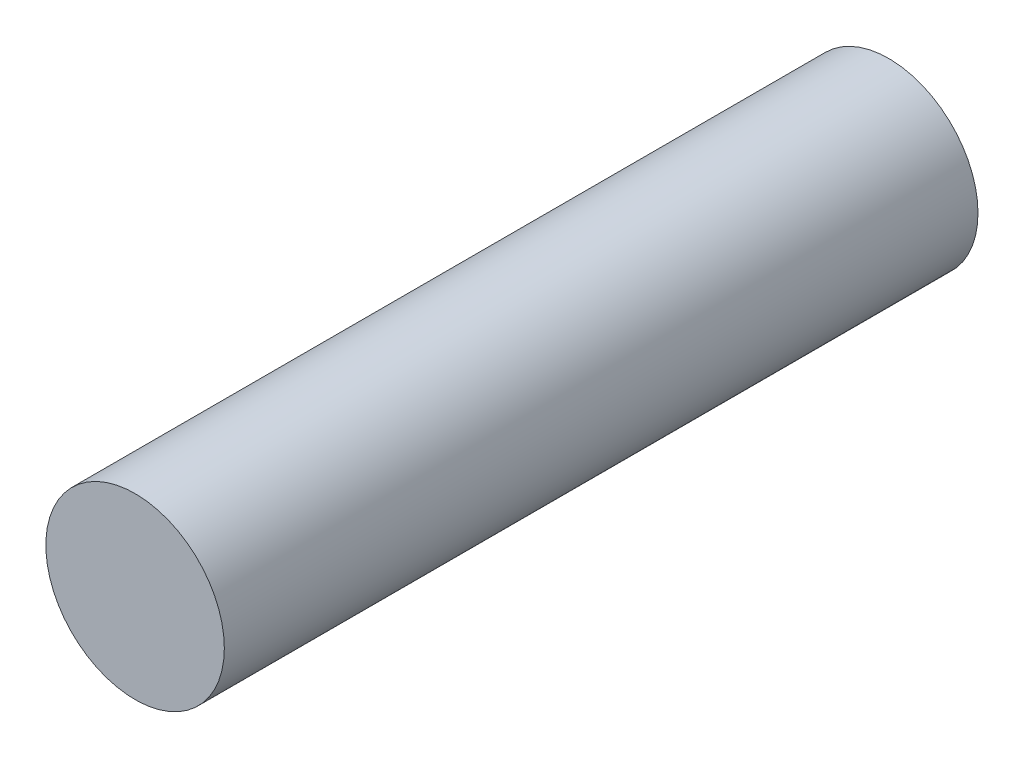
ISO-10303-21;
HEADER;
FILE_DESCRIPTION(('STEP AP214'),'2;1');
FILE_NAME('part.step','',(''),(''),'','','');
FILE_SCHEMA(('AUTOMOTIVE_DESIGN { 1 0 10303 214 1 1 1 1 }'));
ENDSEC;
DATA;
#1=APPLICATION_CONTEXT('core data for automotive mechanical design processes');
#2=APPLICATION_PROTOCOL_DEFINITION('international standard','automotive_design',2000,#1);
#3=PRODUCT_CONTEXT('',#1,'mechanical');
#4=PRODUCT('Part','Part','',(#3));
#5=PRODUCT_RELATED_PRODUCT_CATEGORY('part','',(#4));
#6=PRODUCT_DEFINITION_FORMATION('','',#4);
#7=PRODUCT_DEFINITION_CONTEXT('part definition',#1,'design');
#8=PRODUCT_DEFINITION('design','',#6,#7);
#9=PRODUCT_DEFINITION_SHAPE('','',#8);
#10=(LENGTH_UNIT() NAMED_UNIT(*) SI_UNIT(.MILLI.,.METRE.));
#11=(NAMED_UNIT(*) PLANE_ANGLE_UNIT() SI_UNIT($,.RADIAN.));
#12=(NAMED_UNIT(*) SI_UNIT($,.STERADIAN.) SOLID_ANGLE_UNIT());
#13=UNCERTAINTY_MEASURE_WITH_UNIT(LENGTH_MEASURE(1.E-05),#10,'distance_accuracy_value','');
#14=(GEOMETRIC_REPRESENTATION_CONTEXT(3) GLOBAL_UNCERTAINTY_ASSIGNED_CONTEXT((#13)) GLOBAL_UNIT_ASSIGNED_CONTEXT((#10,
#11,#12)) REPRESENTATION_CONTEXT('',''));
#15=CARTESIAN_POINT('',(0.,0.,0.));
#16=DIRECTION('',(0.,0.,1.));
#17=DIRECTION('',(1.,0.,0.));
#18=AXIS2_PLACEMENT_3D('',#15,#16,#17);
#19=CARTESIAN_POINT('',(0.,0.,76.));
#20=DIRECTION('',(0.,0.,-1.));
#21=DIRECTION('',(-1.,0.,0.));
#22=AXIS2_PLACEMENT_3D('',#19,#20,#21);
#23=CYLINDRICAL_SURFACE('',#22,9.);
#24=CARTESIAN_POINT('',(0.,0.,76.));
#25=DIRECTION('',(0.,0.,1.));
#26=DIRECTION('',(1.,0.,0.));
#27=AXIS2_PLACEMENT_3D('',#24,#25,#26);
#28=CIRCLE('',#27,9.);
#29=CARTESIAN_POINT('',(9.,0.,76.));
#30=VERTEX_POINT('',#29);
#31=EDGE_CURVE('E10',#30,#30,#28,.T.);
#32=ORIENTED_EDGE('',*,*,#31,.F.);
#33=EDGE_LOOP('',(#32));
#34=FACE_BOUND('',#33,.T.);
#35=CARTESIAN_POINT('',(0.,0.,0.));
#36=DIRECTION('',(0.,0.,1.));
#37=DIRECTION('',(1.,0.,0.));
#38=AXIS2_PLACEMENT_3D('',#35,#36,#37);
#39=CIRCLE('',#38,9.);
#40=CARTESIAN_POINT('',(9.,0.,0.));
#41=VERTEX_POINT('',#40);
#42=EDGE_CURVE('E44',#41,#41,#39,.T.);
#43=ORIENTED_EDGE('',*,*,#42,.T.);
#44=EDGE_LOOP('',(#43));
#45=FACE_BOUND('',#44,.T.);
#46=ADVANCED_FACE('F41',(#34,#45),#23,.T.);
#47=CARTESIAN_POINT('',(0.,0.,76.));
#48=DIRECTION('',(0.,0.,1.));
#49=DIRECTION('',(1.,0.,0.));
#50=AXIS2_PLACEMENT_3D('',#47,#48,#49);
#51=PLANE('',#50);
#52=ORIENTED_EDGE('',*,*,#31,.T.);
#53=EDGE_LOOP('',(#52));
#54=FACE_BOUND('',#53,.T.);
#55=ADVANCED_FACE('F58',(#54),#51,.T.);
#56=CARTESIAN_POINT('',(0.,0.,0.));
#57=DIRECTION('',(0.,0.,1.));
#58=DIRECTION('',(1.,0.,0.));
#59=AXIS2_PLACEMENT_3D('',#56,#57,#58);
#60=PLANE('',#59);
#61=ORIENTED_EDGE('',*,*,#42,.F.);
#62=EDGE_LOOP('',(#61));
#63=FACE_BOUND('',#62,.T.);
#64=ADVANCED_FACE('F56',(#63),#60,.F.);
#65=CLOSED_SHELL('',(#46,#55,#64));
#66=MANIFOLD_SOLID_BREP('B2',#65);
#67=ADVANCED_BREP_SHAPE_REPRESENTATION('',(#18,#66),#14);
#68=SHAPE_DEFINITION_REPRESENTATION(#9,#67);
ENDSEC;
END-ISO-10303-21;
